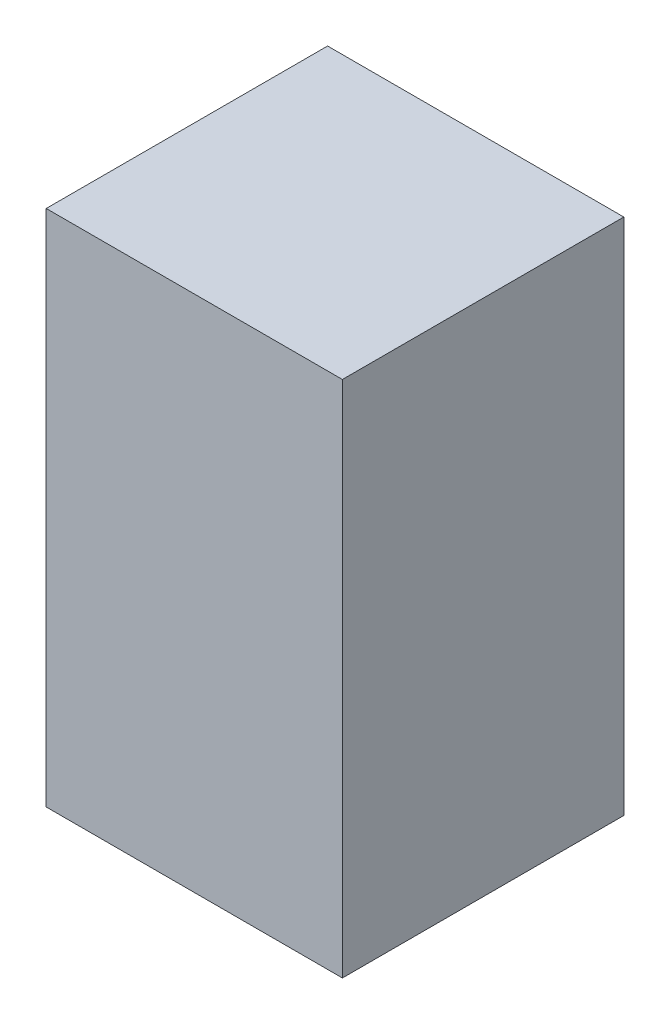
ISO-10303-21;
HEADER;
FILE_DESCRIPTION(('STEP AP214'),'2;1');
FILE_NAME('part.step','',(''),(''),'','','');
FILE_SCHEMA(('AUTOMOTIVE_DESIGN { 1 0 10303 214 1 1 1 1 }'));
ENDSEC;
DATA;
#1=APPLICATION_CONTEXT('core data for automotive mechanical design processes');
#2=APPLICATION_PROTOCOL_DEFINITION('international standard','automotive_design',2000,#1);
#3=PRODUCT_CONTEXT('',#1,'mechanical');
#4=PRODUCT('Part','Part','',(#3));
#5=PRODUCT_RELATED_PRODUCT_CATEGORY('part','',(#4));
#6=PRODUCT_DEFINITION_FORMATION('','',#4);
#7=PRODUCT_DEFINITION_CONTEXT('part definition',#1,'design');
#8=PRODUCT_DEFINITION('design','',#6,#7);
#9=PRODUCT_DEFINITION_SHAPE('','',#8);
#10=(LENGTH_UNIT() NAMED_UNIT(*) SI_UNIT(.MILLI.,.METRE.));
#11=(NAMED_UNIT(*) PLANE_ANGLE_UNIT() SI_UNIT($,.RADIAN.));
#12=(NAMED_UNIT(*) SI_UNIT($,.STERADIAN.) SOLID_ANGLE_UNIT());
#13=UNCERTAINTY_MEASURE_WITH_UNIT(LENGTH_MEASURE(1.E-05),#10,'distance_accuracy_value','');
#14=(GEOMETRIC_REPRESENTATION_CONTEXT(3) GLOBAL_UNCERTAINTY_ASSIGNED_CONTEXT((#13)) GLOBAL_UNIT_ASSIGNED_CONTEXT((#10,
#11,#12)) REPRESENTATION_CONTEXT('',''));
#15=CARTESIAN_POINT('',(0.,0.,0.));
#16=DIRECTION('',(0.,0.,1.));
#17=DIRECTION('',(1.,0.,0.));
#18=AXIS2_PLACEMENT_3D('',#15,#16,#17);
#19=CARTESIAN_POINT('',(0.,0.,24.13));
#20=DIRECTION('',(1.,0.,0.));
#21=DIRECTION('',(0.,0.,-1.));
#22=AXIS2_PLACEMENT_3D('',#19,#20,#21);
#23=PLANE('',#22);
#24=DIRECTION('',(0.,-1.,0.));
#25=VECTOR('',#24,1.);
#26=CARTESIAN_POINT('',(0.,0.,0.));
#27=LINE('',#26,#25);
#28=CARTESIAN_POINT('',(0.,44.45,0.));
#29=VERTEX_POINT('',#28);
#30=CARTESIAN_POINT('',(0.,0.,0.));
#31=VERTEX_POINT('',#30);
#32=EDGE_CURVE('E102',#29,#31,#27,.T.);
#33=ORIENTED_EDGE('',*,*,#32,.T.);
#34=DIRECTION('',(0.,0.,-1.));
#35=VECTOR('',#34,1.);
#36=CARTESIAN_POINT('',(0.,0.,24.13));
#37=LINE('',#36,#35);
#38=CARTESIAN_POINT('',(0.,0.,24.13));
#39=VERTEX_POINT('',#38);
#40=EDGE_CURVE('E11',#39,#31,#37,.T.);
#41=ORIENTED_EDGE('',*,*,#40,.F.);
#42=DIRECTION('',(0.,-1.,0.));
#43=VECTOR('',#42,1.);
#44=CARTESIAN_POINT('',(0.,0.,24.13));
#45=LINE('',#44,#43);
#46=CARTESIAN_POINT('',(0.,44.45,24.13));
#47=VERTEX_POINT('',#46);
#48=EDGE_CURVE('E90',#47,#39,#45,.T.);
#49=ORIENTED_EDGE('',*,*,#48,.F.);
#50=DIRECTION('',(0.,0.,-1.));
#51=VECTOR('',#50,1.);
#52=CARTESIAN_POINT('',(0.,44.45,24.13));
#53=LINE('',#52,#51);
#54=EDGE_CURVE('E98',#47,#29,#53,.T.);
#55=ORIENTED_EDGE('',*,*,#54,.T.);
#56=EDGE_LOOP('',(#33,#41,#49,#55));
#57=FACE_BOUND('',#56,.T.);
#58=ADVANCED_FACE('F39',(#57),#23,.F.);
#59=CARTESIAN_POINT('',(0.,0.,24.13));
#60=DIRECTION('',(0.,1.,0.));
#61=DIRECTION('',(0.,0.,1.));
#62=AXIS2_PLACEMENT_3D('',#59,#60,#61);
#63=PLANE('',#62);
#64=DIRECTION('',(1.,0.,0.));
#65=VECTOR('',#64,1.);
#66=CARTESIAN_POINT('',(0.,0.,0.));
#67=LINE('',#66,#65);
#68=CARTESIAN_POINT('',(25.4,0.,0.));
#69=VERTEX_POINT('',#68);
#70=EDGE_CURVE('E94',#31,#69,#67,.T.);
#71=ORIENTED_EDGE('',*,*,#70,.T.);
#72=DIRECTION('',(0.,0.,-1.));
#73=VECTOR('',#72,1.);
#74=CARTESIAN_POINT('',(25.4,0.,24.13));
#75=LINE('',#74,#73);
#76=CARTESIAN_POINT('',(25.4,0.,24.13));
#77=VERTEX_POINT('',#76);
#78=EDGE_CURVE('E47',#77,#69,#75,.T.);
#79=ORIENTED_EDGE('',*,*,#78,.F.);
#80=DIRECTION('',(1.,0.,0.));
#81=VECTOR('',#80,1.);
#82=CARTESIAN_POINT('',(0.,0.,24.13));
#83=LINE('',#82,#81);
#84=EDGE_CURVE('E85',#39,#77,#83,.T.);
#85=ORIENTED_EDGE('',*,*,#84,.F.);
#86=ORIENTED_EDGE('',*,*,#40,.T.);
#87=EDGE_LOOP('',(#71,#79,#85,#86));
#88=FACE_BOUND('',#87,.T.);
#89=ADVANCED_FACE('F93',(#88),#63,.F.);
#90=CARTESIAN_POINT('',(25.4,0.,24.13));
#91=DIRECTION('',(-1.,0.,0.));
#92=DIRECTION('',(0.,0.,1.));
#93=AXIS2_PLACEMENT_3D('',#90,#91,#92);
#94=PLANE('',#93);
#95=DIRECTION('',(0.,1.,0.));
#96=VECTOR('',#95,1.);
#97=CARTESIAN_POINT('',(25.4,0.,0.));
#98=LINE('',#97,#96);
#99=CARTESIAN_POINT('',(25.4,44.45,0.));
#100=VERTEX_POINT('',#99);
#101=EDGE_CURVE('E72',#69,#100,#98,.T.);
#102=ORIENTED_EDGE('',*,*,#101,.T.);
#103=DIRECTION('',(0.,0.,-1.));
#104=VECTOR('',#103,1.);
#105=CARTESIAN_POINT('',(25.4,44.45,24.13));
#106=LINE('',#105,#104);
#107=CARTESIAN_POINT('',(25.4,44.45,24.13));
#108=VERTEX_POINT('',#107);
#109=EDGE_CURVE('E95',#108,#100,#106,.T.);
#110=ORIENTED_EDGE('',*,*,#109,.F.);
#111=DIRECTION('',(0.,1.,0.));
#112=VECTOR('',#111,1.);
#113=CARTESIAN_POINT('',(25.4,0.,24.13));
#114=LINE('',#113,#112);
#115=EDGE_CURVE('E88',#77,#108,#114,.T.);
#116=ORIENTED_EDGE('',*,*,#115,.F.);
#117=ORIENTED_EDGE('',*,*,#78,.T.);
#118=EDGE_LOOP('',(#102,#110,#116,#117));
#119=FACE_BOUND('',#118,.T.);
#120=ADVANCED_FACE('F96',(#119),#94,.F.);
#121=CARTESIAN_POINT('',(0.,44.45,24.13));
#122=DIRECTION('',(0.,-1.,0.));
#123=DIRECTION('',(0.,0.,-1.));
#124=AXIS2_PLACEMENT_3D('',#121,#122,#123);
#125=PLANE('',#124);
#126=DIRECTION('',(-1.,0.,0.));
#127=VECTOR('',#126,1.);
#128=CARTESIAN_POINT('',(0.,44.45,0.));
#129=LINE('',#128,#127);
#130=EDGE_CURVE('E78',#100,#29,#129,.T.);
#131=ORIENTED_EDGE('',*,*,#130,.T.);
#132=ORIENTED_EDGE('',*,*,#54,.F.);
#133=DIRECTION('',(-1.,0.,0.));
#134=VECTOR('',#133,1.);
#135=CARTESIAN_POINT('',(0.,44.45,24.13));
#136=LINE('',#135,#134);
#137=EDGE_CURVE('E55',#108,#47,#136,.T.);
#138=ORIENTED_EDGE('',*,*,#137,.F.);
#139=ORIENTED_EDGE('',*,*,#109,.T.);
#140=EDGE_LOOP('',(#131,#132,#138,#139));
#141=FACE_BOUND('',#140,.T.);
#142=ADVANCED_FACE('F109',(#141),#125,.F.);
#143=CARTESIAN_POINT('',(0.,0.,24.13));
#144=DIRECTION('',(0.,0.,-1.));
#145=DIRECTION('',(-1.,0.,0.));
#146=AXIS2_PLACEMENT_3D('',#143,#144,#145);
#147=PLANE('',#146);
#148=ORIENTED_EDGE('',*,*,#48,.T.);
#149=ORIENTED_EDGE('',*,*,#84,.T.);
#150=ORIENTED_EDGE('',*,*,#115,.T.);
#151=ORIENTED_EDGE('',*,*,#137,.T.);
#152=EDGE_LOOP('',(#148,#149,#150,#151));
#153=FACE_BOUND('',#152,.T.);
#154=ADVANCED_FACE('F86',(#153),#147,.F.);
#155=CARTESIAN_POINT('',(0.,0.,0.));
#156=DIRECTION('',(0.,0.,-1.));
#157=DIRECTION('',(-1.,0.,0.));
#158=AXIS2_PLACEMENT_3D('',#155,#156,#157);
#159=PLANE('',#158);
#160=ORIENTED_EDGE('',*,*,#32,.F.);
#161=ORIENTED_EDGE('',*,*,#130,.F.);
#162=ORIENTED_EDGE('',*,*,#101,.F.);
#163=ORIENTED_EDGE('',*,*,#70,.F.);
#164=EDGE_LOOP('',(#160,#161,#162,#163));
#165=FACE_BOUND('',#164,.T.);
#166=ADVANCED_FACE('F112',(#165),#159,.T.);
#167=CLOSED_SHELL('',(#58,#89,#120,#142,#154,#166));
#168=MANIFOLD_SOLID_BREP('B2',#167);
#169=ADVANCED_BREP_SHAPE_REPRESENTATION('',(#18,#168),#14);
#170=SHAPE_DEFINITION_REPRESENTATION(#9,#169);
ENDSEC;
END-ISO-10303-21;
